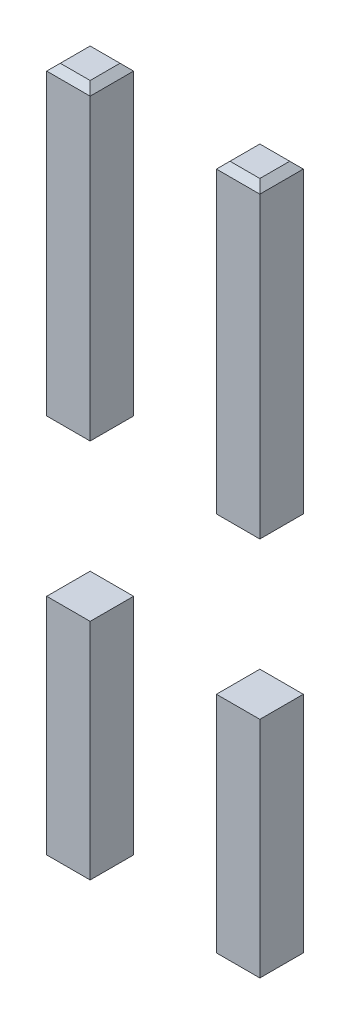
ISO-10303-21;
HEADER;
FILE_DESCRIPTION(('STEP AP214'),'2;1');
FILE_NAME('part.step','',(''),(''),'','','');
FILE_SCHEMA(('AUTOMOTIVE_DESIGN { 1 0 10303 214 1 1 1 1 }'));
ENDSEC;
DATA;
#1=APPLICATION_CONTEXT('core data for automotive mechanical design processes');
#2=APPLICATION_PROTOCOL_DEFINITION('international standard','automotive_design',2000,#1);
#3=PRODUCT_CONTEXT('',#1,'mechanical');
#4=PRODUCT('Part','Part','',(#3));
#5=PRODUCT_RELATED_PRODUCT_CATEGORY('part','',(#4));
#6=PRODUCT_DEFINITION_FORMATION('','',#4);
#7=PRODUCT_DEFINITION_CONTEXT('part definition',#1,'design');
#8=PRODUCT_DEFINITION('design','',#6,#7);
#9=PRODUCT_DEFINITION_SHAPE('','',#8);
#10=(LENGTH_UNIT() NAMED_UNIT(*) SI_UNIT(.MILLI.,.METRE.));
#11=(NAMED_UNIT(*) PLANE_ANGLE_UNIT() SI_UNIT($,.RADIAN.));
#12=(NAMED_UNIT(*) SI_UNIT($,.STERADIAN.) SOLID_ANGLE_UNIT());
#13=UNCERTAINTY_MEASURE_WITH_UNIT(LENGTH_MEASURE(1.E-05),#10,'distance_accuracy_value','');
#14=(GEOMETRIC_REPRESENTATION_CONTEXT(3) GLOBAL_UNCERTAINTY_ASSIGNED_CONTEXT((#13)) GLOBAL_UNIT_ASSIGNED_CONTEXT((#10,
#11,#12)) REPRESENTATION_CONTEXT('',''));
#15=CARTESIAN_POINT('',(0.,0.,0.));
#16=DIRECTION('',(0.,0.,1.));
#17=DIRECTION('',(1.,0.,0.));
#18=AXIS2_PLACEMENT_3D('',#15,#16,#17);
#19=CARTESIAN_POINT('',(-1.57,7.705096679919,0.82));
#20=DIRECTION('',(0.,0.,-1.));
#21=DIRECTION('',(-1.,0.,0.));
#22=AXIS2_PLACEMENT_3D('',#19,#20,#21);
#23=PLANE('',#22);
#24=DIRECTION('',(-1.,0.,0.));
#25=VECTOR('',#24,1.);
#26=CARTESIAN_POINT('',(-1.57,-3.3,0.82));
#27=LINE('',#26,#25);
#28=CARTESIAN_POINT('',(-0.93,-3.3,0.82));
#29=VERTEX_POINT('',#28);
#30=CARTESIAN_POINT('',(-1.57,-3.3,0.82));
#31=VERTEX_POINT('',#30);
#32=EDGE_CURVE('P0_E82',#29,#31,#27,.T.);
#33=ORIENTED_EDGE('',*,*,#32,.F.);
#34=DIRECTION('',(0.,-1.,0.));
#35=VECTOR('',#34,1.);
#36=CARTESIAN_POINT('',(-0.93,7.705096679919,0.82));
#37=LINE('',#36,#35);
#38=CARTESIAN_POINT('',(-0.93,0.,0.82));
#39=VERTEX_POINT('',#38);
#40=EDGE_CURVE('P0_E78',#39,#29,#37,.T.);
#41=ORIENTED_EDGE('',*,*,#40,.F.);
#42=DIRECTION('',(-1.,0.,0.));
#43=VECTOR('',#42,1.);
#44=CARTESIAN_POINT('',(3.7,0.,0.82));
#45=LINE('',#44,#43);
#46=CARTESIAN_POINT('',(-1.57,0.,0.82));
#47=VERTEX_POINT('',#46);
#48=EDGE_CURVE('P0_E80',#39,#47,#45,.T.);
#49=ORIENTED_EDGE('',*,*,#48,.T.);
#50=DIRECTION('',(0.,-1.,0.));
#51=VECTOR('',#50,1.);
#52=CARTESIAN_POINT('',(-1.57,7.705096679919,0.82));
#53=LINE('',#52,#51);
#54=EDGE_CURVE('P0_E11',#47,#31,#53,.T.);
#55=ORIENTED_EDGE('',*,*,#54,.T.);
#56=EDGE_LOOP('',(#33,#41,#49,#55));
#57=FACE_BOUND('',#56,.T.);
#58=ADVANCED_FACE('P0_F17',(#57),#23,.F.);
#59=CARTESIAN_POINT('',(-1.57,7.705096679919,0.82));
#60=DIRECTION('',(1.,0.,0.));
#61=DIRECTION('',(0.,1.,0.));
#62=AXIS2_PLACEMENT_3D('',#59,#60,#61);
#63=PLANE('',#62);
#64=DIRECTION('',(0.,0.,-1.));
#65=VECTOR('',#64,1.);
#66=CARTESIAN_POINT('',(-1.57,-3.3,0.5));
#67=LINE('',#66,#65);
#68=CARTESIAN_POINT('',(-1.57,-3.3,0.18));
#69=VERTEX_POINT('',#68);
#70=EDGE_CURVE('P0_E21',#31,#69,#67,.T.);
#71=ORIENTED_EDGE('',*,*,#70,.F.);
#72=ORIENTED_EDGE('',*,*,#54,.F.);
#73=DIRECTION('',(0.,0.,-1.));
#74=VECTOR('',#73,1.);
#75=CARTESIAN_POINT('',(-1.57,0.,2.875));
#76=LINE('',#75,#74);
#77=CARTESIAN_POINT('',(-1.57,0.,0.18));
#78=VERTEX_POINT('',#77);
#79=EDGE_CURVE('P0_E96',#47,#78,#76,.T.);
#80=ORIENTED_EDGE('',*,*,#79,.T.);
#81=DIRECTION('',(0.,-1.,0.));
#82=VECTOR('',#81,1.);
#83=CARTESIAN_POINT('',(-1.57,7.705096679919,0.18));
#84=LINE('',#83,#82);
#85=EDGE_CURVE('P0_E28',#78,#69,#84,.T.);
#86=ORIENTED_EDGE('',*,*,#85,.T.);
#87=EDGE_LOOP('',(#71,#72,#80,#86));
#88=FACE_BOUND('',#87,.T.);
#89=ADVANCED_FACE('P0_F226',(#88),#63,.F.);
#90=CARTESIAN_POINT('',(-1.57,-3.4,0.18));
#91=DIRECTION('',(0.,-1.,0.));
#92=DIRECTION('',(0.,0.,-1.));
#93=AXIS2_PLACEMENT_3D('',#90,#91,#92);
#94=PLANE('',#93);
#95=DIRECTION('',(-1.,0.,0.));
#96=VECTOR('',#95,1.);
#97=CARTESIAN_POINT('',(-1.57,-3.4,0.28));
#98=LINE('',#97,#96);
#99=CARTESIAN_POINT('',(-1.03,-3.4,0.28));
#100=VERTEX_POINT('',#99);
#101=CARTESIAN_POINT('',(-1.47,-3.4,0.28));
#102=VERTEX_POINT('',#101);
#103=EDGE_CURVE('P0_E113',#100,#102,#98,.T.);
#104=ORIENTED_EDGE('',*,*,#103,.F.);
#105=DIRECTION('',(0.,0.,-1.));
#106=VECTOR('',#105,1.);
#107=CARTESIAN_POINT('',(-1.03,-3.4,0.5));
#108=LINE('',#107,#106);
#109=CARTESIAN_POINT('',(-1.03,-3.4,0.72));
#110=VERTEX_POINT('',#109);
#111=EDGE_CURVE('P0_E123',#110,#100,#108,.T.);
#112=ORIENTED_EDGE('',*,*,#111,.F.);
#113=DIRECTION('',(1.,0.,0.));
#114=VECTOR('',#113,1.);
#115=CARTESIAN_POINT('',(-1.57,-3.4,0.72));
#116=LINE('',#115,#114);
#117=CARTESIAN_POINT('',(-1.47,-3.4,0.72));
#118=VERTEX_POINT('',#117);
#119=EDGE_CURVE('P0_E147',#118,#110,#116,.T.);
#120=ORIENTED_EDGE('',*,*,#119,.F.);
#121=DIRECTION('',(0.,0.,1.));
#122=VECTOR('',#121,1.);
#123=CARTESIAN_POINT('',(-1.47,-3.4,0.5));
#124=LINE('',#123,#122);
#125=EDGE_CURVE('P0_E128',#102,#118,#124,.T.);
#126=ORIENTED_EDGE('',*,*,#125,.F.);
#127=EDGE_LOOP('',(#104,#112,#120,#126));
#128=FACE_BOUND('',#127,.T.);
#129=ADVANCED_FACE('P0_F176',(#128),#94,.T.);
#130=CARTESIAN_POINT('',(-1.57,7.705096679919,0.18));
#131=DIRECTION('',(0.,0.,1.));
#132=DIRECTION('',(1.,0.,0.));
#133=AXIS2_PLACEMENT_3D('',#130,#131,#132);
#134=PLANE('',#133);
#135=DIRECTION('',(1.,0.,0.));
#136=VECTOR('',#135,1.);
#137=CARTESIAN_POINT('',(-1.57,-3.3,0.18));
#138=LINE('',#137,#136);
#139=CARTESIAN_POINT('',(-0.93,-3.3,0.18));
#140=VERTEX_POINT('',#139);
#141=EDGE_CURVE('P0_E98',#69,#140,#138,.T.);
#142=ORIENTED_EDGE('',*,*,#141,.F.);
#143=ORIENTED_EDGE('',*,*,#85,.F.);
#144=DIRECTION('',(1.,0.,0.));
#145=VECTOR('',#144,1.);
#146=CARTESIAN_POINT('',(3.7,0.,0.18));
#147=LINE('',#146,#145);
#148=CARTESIAN_POINT('',(-0.93,0.,0.18));
#149=VERTEX_POINT('',#148);
#150=EDGE_CURVE('P0_E103',#78,#149,#147,.T.);
#151=ORIENTED_EDGE('',*,*,#150,.T.);
#152=DIRECTION('',(0.,-1.,0.));
#153=VECTOR('',#152,1.);
#154=CARTESIAN_POINT('',(-0.93,7.705096679919,0.18));
#155=LINE('',#154,#153);
#156=EDGE_CURVE('P0_E88',#149,#140,#155,.T.);
#157=ORIENTED_EDGE('',*,*,#156,.T.);
#158=EDGE_LOOP('',(#142,#143,#151,#157));
#159=FACE_BOUND('',#158,.T.);
#160=ADVANCED_FACE('P0_F170',(#159),#134,.F.);
#161=CARTESIAN_POINT('',(-0.93,7.705096679919,0.82));
#162=DIRECTION('',(-1.,0.,0.));
#163=DIRECTION('',(0.,1.,0.));
#164=AXIS2_PLACEMENT_3D('',#161,#162,#163);
#165=PLANE('',#164);
#166=DIRECTION('',(0.,0.,1.));
#167=VECTOR('',#166,1.);
#168=CARTESIAN_POINT('',(-0.93,-3.3,0.5));
#169=LINE('',#168,#167);
#170=EDGE_CURVE('P0_E124',#140,#29,#169,.T.);
#171=ORIENTED_EDGE('',*,*,#170,.F.);
#172=ORIENTED_EDGE('',*,*,#156,.F.);
#173=DIRECTION('',(0.,0.,1.));
#174=VECTOR('',#173,1.);
#175=CARTESIAN_POINT('',(-0.93,0.,2.875));
#176=LINE('',#175,#174);
#177=EDGE_CURVE('P0_E94',#149,#39,#176,.T.);
#178=ORIENTED_EDGE('',*,*,#177,.T.);
#179=ORIENTED_EDGE('',*,*,#40,.T.);
#180=EDGE_LOOP('',(#171,#172,#178,#179));
#181=FACE_BOUND('',#180,.T.);
#182=ADVANCED_FACE('P0_F100',(#181),#165,.F.);
#183=CARTESIAN_POINT('',(-1.57,-3.35,0.77));
#184=DIRECTION('',(0.,-0.707106781186548,0.707106781186548));
#185=DIRECTION('',(-1.,0.,0.));
#186=AXIS2_PLACEMENT_3D('',#183,#184,#185);
#187=PLANE('',#186);
#188=ORIENTED_EDGE('',*,*,#32,.T.);
#189=DIRECTION('',(-0.577350269189626,0.577350269189626,0.577350269189626));
#190=VECTOR('',#189,1.);
#191=CARTESIAN_POINT('',(-1.47,-3.4,0.72));
#192=LINE('',#191,#190);
#193=EDGE_CURVE('P0_E125',#118,#31,#192,.T.);
#194=ORIENTED_EDGE('',*,*,#193,.F.);
#195=ORIENTED_EDGE('',*,*,#119,.T.);
#196=DIRECTION('',(-0.577350269189626,-0.577350269189626,-0.577350269189626));
#197=VECTOR('',#196,1.);
#198=CARTESIAN_POINT('',(-0.93,-3.3,0.82));
#199=LINE('',#198,#197);
#200=EDGE_CURVE('P0_E119',#29,#110,#199,.T.);
#201=ORIENTED_EDGE('',*,*,#200,.F.);
#202=EDGE_LOOP('',(#188,#194,#195,#201));
#203=FACE_BOUND('',#202,.T.);
#204=ADVANCED_FACE('P0_F194',(#203),#187,.T.);
#205=CARTESIAN_POINT('',(-1.52,-3.35,0.5));
#206=DIRECTION('',(-0.707106781186548,-0.707106781186548,0.));
#207=DIRECTION('',(-0.707106781186548,0.707106781186548,0.));
#208=AXIS2_PLACEMENT_3D('',#205,#206,#207);
#209=PLANE('',#208);
#210=ORIENTED_EDGE('',*,*,#125,.T.);
#211=ORIENTED_EDGE('',*,*,#193,.T.);
#212=ORIENTED_EDGE('',*,*,#70,.T.);
#213=DIRECTION('',(-0.577350269189626,0.577350269189626,-0.577350269189626));
#214=VECTOR('',#213,1.);
#215=CARTESIAN_POINT('',(-1.47,-3.4,0.28));
#216=LINE('',#215,#214);
#217=EDGE_CURVE('P0_E117',#102,#69,#216,.T.);
#218=ORIENTED_EDGE('',*,*,#217,.F.);
#219=EDGE_LOOP('',(#210,#211,#212,#218));
#220=FACE_BOUND('',#219,.T.);
#221=ADVANCED_FACE('P0_F189',(#220),#209,.T.);
#222=CARTESIAN_POINT('',(-0.98,-3.35,0.5));
#223=DIRECTION('',(0.707106781186548,-0.707106781186548,0.));
#224=DIRECTION('',(0.,0.,-1.));
#225=AXIS2_PLACEMENT_3D('',#222,#223,#224);
#226=PLANE('',#225);
#227=ORIENTED_EDGE('',*,*,#170,.T.);
#228=ORIENTED_EDGE('',*,*,#200,.T.);
#229=ORIENTED_EDGE('',*,*,#111,.T.);
#230=DIRECTION('',(-0.577350269189626,-0.577350269189626,0.577350269189626));
#231=VECTOR('',#230,1.);
#232=CARTESIAN_POINT('',(-0.93,-3.3,0.18));
#233=LINE('',#232,#231);
#234=EDGE_CURVE('P0_E118',#140,#100,#233,.T.);
#235=ORIENTED_EDGE('',*,*,#234,.F.);
#236=EDGE_LOOP('',(#227,#228,#229,#235));
#237=FACE_BOUND('',#236,.T.);
#238=ADVANCED_FACE('P0_F173',(#237),#226,.T.);
#239=CARTESIAN_POINT('',(-1.57,-3.35,0.23));
#240=DIRECTION('',(0.,-0.707106781186548,-0.707106781186548));
#241=DIRECTION('',(0.,-0.707106781186548,0.707106781186548));
#242=AXIS2_PLACEMENT_3D('',#239,#240,#241);
#243=PLANE('',#242);
#244=ORIENTED_EDGE('',*,*,#141,.T.);
#245=ORIENTED_EDGE('',*,*,#234,.T.);
#246=ORIENTED_EDGE('',*,*,#103,.T.);
#247=ORIENTED_EDGE('',*,*,#217,.T.);
#248=EDGE_LOOP('',(#244,#245,#246,#247));
#249=FACE_BOUND('',#248,.T.);
#250=ADVANCED_FACE('P0_F19',(#249),#243,.T.);
#251=CARTESIAN_POINT('',(-0.93,0.,0.));
#252=DIRECTION('',(0.,1.,0.));
#253=DIRECTION('',(1.,0.,0.));
#254=AXIS2_PLACEMENT_3D('',#251,#252,#253);
#255=PLANE('',#254);
#256=ORIENTED_EDGE('',*,*,#177,.F.);
#257=ORIENTED_EDGE('',*,*,#150,.F.);
#258=ORIENTED_EDGE('',*,*,#79,.F.);
#259=ORIENTED_EDGE('',*,*,#48,.F.);
#260=EDGE_LOOP('',(#256,#257,#258,#259));
#261=FACE_BOUND('',#260,.T.);
#262=ADVANCED_FACE('P0_F92',(#261),#255,.T.);
#263=CLOSED_SHELL('',(#58,#89,#129,#160,#182,#204,#221,#238,#250,#262));
#264=MANIFOLD_SOLID_BREP('P0_B1',#263);
#265=CARTESIAN_POINT('',(-0.93,2.3,0.82));
#266=DIRECTION('',(0.,-1.,0.));
#267=DIRECTION('',(0.,0.,-1.));
#268=AXIS2_PLACEMENT_3D('',#265,#266,#267);
#269=PLANE('',#268);
#270=DIRECTION('',(0.,0.,-1.));
#271=VECTOR('',#270,1.);
#272=CARTESIAN_POINT('',(1.57,2.3,-2.05));
#273=LINE('',#272,#271);
#274=CARTESIAN_POINT('',(1.57,2.3,0.82));
#275=VERTEX_POINT('',#274);
#276=CARTESIAN_POINT('',(1.57,2.3,0.18));
#277=VERTEX_POINT('',#276);
#278=EDGE_CURVE('P1_E90',#275,#277,#273,.T.);
#279=ORIENTED_EDGE('',*,*,#278,.F.);
#280=DIRECTION('',(1.,0.,0.));
#281=VECTOR('',#280,1.);
#282=CARTESIAN_POINT('',(-2.85,2.3,0.82));
#283=LINE('',#282,#281);
#284=CARTESIAN_POINT('',(0.93,2.3,0.82));
#285=VERTEX_POINT('',#284);
#286=EDGE_CURVE('P1_E21',#285,#275,#283,.T.);
#287=ORIENTED_EDGE('',*,*,#286,.F.);
#288=DIRECTION('',(0.,0.,1.));
#289=VECTOR('',#288,1.);
#290=CARTESIAN_POINT('',(0.93,2.3,-2.05));
#291=LINE('',#290,#289);
#292=CARTESIAN_POINT('',(0.93,2.3,0.18));
#293=VERTEX_POINT('',#292);
#294=EDGE_CURVE('P1_E100',#293,#285,#291,.T.);
#295=ORIENTED_EDGE('',*,*,#294,.F.);
#296=DIRECTION('',(-1.,0.,0.));
#297=VECTOR('',#296,1.);
#298=CARTESIAN_POINT('',(-2.85,2.3,0.18));
#299=LINE('',#298,#297);
#300=EDGE_CURVE('P1_E40',#277,#293,#299,.T.);
#301=ORIENTED_EDGE('',*,*,#300,.F.);
#302=EDGE_LOOP('',(#279,#287,#295,#301));
#303=FACE_BOUND('',#302,.T.);
#304=ADVANCED_FACE('P1_F17',(#303),#269,.T.);
#305=CARTESIAN_POINT('',(1.52,6.75,0.66));
#306=DIRECTION('',(0.707106781186548,0.707106781186548,0.));
#307=DIRECTION('',(0.,0.,-1.));
#308=AXIS2_PLACEMENT_3D('',#305,#306,#307);
#309=PLANE('',#308);
#310=DIRECTION('',(0.,0.,1.));
#311=VECTOR('',#310,1.);
#312=CARTESIAN_POINT('',(1.47,6.8,0.66));
#313=LINE('',#312,#311);
#314=CARTESIAN_POINT('',(1.47,6.8,0.28));
#315=VERTEX_POINT('',#314);
#316=CARTESIAN_POINT('',(1.47,6.8,0.72));
#317=VERTEX_POINT('',#316);
#318=EDGE_CURVE('P1_E120',#315,#317,#313,.T.);
#319=ORIENTED_EDGE('',*,*,#318,.T.);
#320=DIRECTION('',(0.577350269189626,-0.577350269189626,0.577350269189626));
#321=VECTOR('',#320,1.);
#322=CARTESIAN_POINT('',(1.47,6.8,0.72));
#323=LINE('',#322,#321);
#324=CARTESIAN_POINT('',(1.57,6.7,0.82));
#325=VERTEX_POINT('',#324);
#326=EDGE_CURVE('P1_E11',#317,#325,#323,.T.);
#327=ORIENTED_EDGE('',*,*,#326,.T.);
#328=DIRECTION('',(0.,0.,-1.));
#329=VECTOR('',#328,1.);
#330=CARTESIAN_POINT('',(1.57,6.7,0.66));
#331=LINE('',#330,#329);
#332=CARTESIAN_POINT('',(1.57,6.7,0.18));
#333=VERTEX_POINT('',#332);
#334=EDGE_CURVE('P1_E123',#325,#333,#331,.T.);
#335=ORIENTED_EDGE('',*,*,#334,.T.);
#336=DIRECTION('',(0.577350269189626,-0.577350269189626,-0.577350269189626));
#337=VECTOR('',#336,1.);
#338=CARTESIAN_POINT('',(1.47,6.8,0.28));
#339=LINE('',#338,#337);
#340=EDGE_CURVE('P1_E53',#315,#333,#339,.T.);
#341=ORIENTED_EDGE('',*,*,#340,.F.);
#342=EDGE_LOOP('',(#319,#327,#335,#341));
#343=FACE_BOUND('',#342,.T.);
#344=ADVANCED_FACE('P1_F19',(#343),#309,.T.);
#345=CARTESIAN_POINT('',(0.465,6.75,0.77));
#346=DIRECTION('',(0.,0.707106781186548,0.707106781186548));
#347=DIRECTION('',(1.,0.,0.));
#348=AXIS2_PLACEMENT_3D('',#345,#346,#347);
#349=PLANE('',#348);
#350=DIRECTION('',(1.,0.,0.));
#351=VECTOR('',#350,1.);
#352=CARTESIAN_POINT('',(0.465,6.7,0.82));
#353=LINE('',#352,#351);
#354=CARTESIAN_POINT('',(0.93,6.7,0.82));
#355=VERTEX_POINT('',#354);
#356=EDGE_CURVE('P1_E111',#355,#325,#353,.T.);
#357=ORIENTED_EDGE('',*,*,#356,.T.);
#358=ORIENTED_EDGE('',*,*,#326,.F.);
#359=DIRECTION('',(-1.,0.,0.));
#360=VECTOR('',#359,1.);
#361=CARTESIAN_POINT('',(0.465,6.8,0.72));
#362=LINE('',#361,#360);
#363=CARTESIAN_POINT('',(1.03,6.8,0.72));
#364=VERTEX_POINT('',#363);
#365=EDGE_CURVE('P1_E108',#317,#364,#362,.T.);
#366=ORIENTED_EDGE('',*,*,#365,.T.);
#367=DIRECTION('',(-0.577350269189626,-0.577350269189626,0.577350269189626));
#368=VECTOR('',#367,1.);
#369=CARTESIAN_POINT('',(1.03,6.8,0.72));
#370=LINE('',#369,#368);
#371=EDGE_CURVE('P1_E27',#364,#355,#370,.T.);
#372=ORIENTED_EDGE('',*,*,#371,.T.);
#373=EDGE_LOOP('',(#357,#358,#366,#372));
#374=FACE_BOUND('',#373,.T.);
#375=ADVANCED_FACE('P1_F107',(#374),#349,.T.);
#376=CARTESIAN_POINT('',(0.98,6.75,0.66));
#377=DIRECTION('',(-0.707106781186548,0.707106781186548,0.));
#378=DIRECTION('',(0.,0.,1.));
#379=AXIS2_PLACEMENT_3D('',#376,#377,#378);
#380=PLANE('',#379);
#381=DIRECTION('',(0.,0.,1.));
#382=VECTOR('',#381,1.);
#383=CARTESIAN_POINT('',(0.93,6.7,0.66));
#384=LINE('',#383,#382);
#385=CARTESIAN_POINT('',(0.93,6.7,0.18));
#386=VERTEX_POINT('',#385);
#387=EDGE_CURVE('P1_E138',#386,#355,#384,.T.);
#388=ORIENTED_EDGE('',*,*,#387,.T.);
#389=ORIENTED_EDGE('',*,*,#371,.F.);
#390=DIRECTION('',(0.,0.,-1.));
#391=VECTOR('',#390,1.);
#392=CARTESIAN_POINT('',(1.03,6.8,0.66));
#393=LINE('',#392,#391);
#394=CARTESIAN_POINT('',(1.03,6.8,0.28));
#395=VERTEX_POINT('',#394);
#396=EDGE_CURVE('P1_E121',#364,#395,#393,.T.);
#397=ORIENTED_EDGE('',*,*,#396,.T.);
#398=DIRECTION('',(-0.577350269189626,-0.577350269189626,-0.577350269189626));
#399=VECTOR('',#398,1.);
#400=CARTESIAN_POINT('',(1.03,6.8,0.28));
#401=LINE('',#400,#399);
#402=EDGE_CURVE('P1_E83',#395,#386,#401,.T.);
#403=ORIENTED_EDGE('',*,*,#402,.T.);
#404=EDGE_LOOP('',(#388,#389,#397,#403));
#405=FACE_BOUND('',#404,.T.);
#406=ADVANCED_FACE('P1_F178',(#405),#380,.T.);
#407=CARTESIAN_POINT('',(0.465,6.75,0.23));
#408=DIRECTION('',(0.,0.707106781186548,-0.707106781186548));
#409=DIRECTION('',(-1.,0.,0.));
#410=AXIS2_PLACEMENT_3D('',#407,#408,#409);
#411=PLANE('',#410);
#412=DIRECTION('',(-1.,0.,0.));
#413=VECTOR('',#412,1.);
#414=CARTESIAN_POINT('',(0.465,6.7,0.18));
#415=LINE('',#414,#413);
#416=EDGE_CURVE('P1_E154',#333,#386,#415,.T.);
#417=ORIENTED_EDGE('',*,*,#416,.T.);
#418=ORIENTED_EDGE('',*,*,#402,.F.);
#419=DIRECTION('',(1.,0.,0.));
#420=VECTOR('',#419,1.);
#421=CARTESIAN_POINT('',(0.465,6.8,0.28));
#422=LINE('',#421,#420);
#423=EDGE_CURVE('P1_E126',#395,#315,#422,.T.);
#424=ORIENTED_EDGE('',*,*,#423,.T.);
#425=ORIENTED_EDGE('',*,*,#340,.T.);
#426=EDGE_LOOP('',(#417,#418,#424,#425));
#427=FACE_BOUND('',#426,.T.);
#428=ADVANCED_FACE('P1_F179',(#427),#411,.T.);
#429=CARTESIAN_POINT('',(0.93,7.705096679919,0.18));
#430=DIRECTION('',(0.,0.,1.));
#431=DIRECTION('',(1.,0.,0.));
#432=AXIS2_PLACEMENT_3D('',#429,#430,#431);
#433=PLANE('',#432);
#434=ORIENTED_EDGE('',*,*,#416,.F.);
#435=DIRECTION('',(0.,-1.,0.));
#436=VECTOR('',#435,1.);
#437=CARTESIAN_POINT('',(1.57,7.705096679919,0.18));
#438=LINE('',#437,#436);
#439=EDGE_CURVE('P1_E148',#333,#277,#438,.T.);
#440=ORIENTED_EDGE('',*,*,#439,.T.);
#441=ORIENTED_EDGE('',*,*,#300,.T.);
#442=DIRECTION('',(0.,-1.,0.));
#443=VECTOR('',#442,1.);
#444=CARTESIAN_POINT('',(0.93,7.705096679919,0.18));
#445=LINE('',#444,#443);
#446=EDGE_CURVE('P1_E134',#386,#293,#445,.T.);
#447=ORIENTED_EDGE('',*,*,#446,.F.);
#448=EDGE_LOOP('',(#434,#440,#441,#447));
#449=FACE_BOUND('',#448,.T.);
#450=ADVANCED_FACE('P1_F172',(#449),#433,.F.);
#451=CARTESIAN_POINT('',(1.57,7.705096679919,0.82));
#452=DIRECTION('',(-1.,0.,0.));
#453=DIRECTION('',(0.,1.,0.));
#454=AXIS2_PLACEMENT_3D('',#451,#452,#453);
#455=PLANE('',#454);
#456=ORIENTED_EDGE('',*,*,#334,.F.);
#457=DIRECTION('',(0.,-1.,0.));
#458=VECTOR('',#457,1.);
#459=CARTESIAN_POINT('',(1.57,7.705096679919,0.82));
#460=LINE('',#459,#458);
#461=EDGE_CURVE('P1_E141',#325,#275,#460,.T.);
#462=ORIENTED_EDGE('',*,*,#461,.T.);
#463=ORIENTED_EDGE('',*,*,#278,.T.);
#464=ORIENTED_EDGE('',*,*,#439,.F.);
#465=EDGE_LOOP('',(#456,#462,#463,#464));
#466=FACE_BOUND('',#465,.T.);
#467=ADVANCED_FACE('P1_F187',(#466),#455,.F.);
#468=CARTESIAN_POINT('',(0.,6.8,0.5));
#469=DIRECTION('',(0.,-1.,0.));
#470=DIRECTION('',(0.,0.,-1.));
#471=AXIS2_PLACEMENT_3D('',#468,#469,#470);
#472=PLANE('',#471);
#473=ORIENTED_EDGE('',*,*,#318,.F.);
#474=ORIENTED_EDGE('',*,*,#423,.F.);
#475=ORIENTED_EDGE('',*,*,#396,.F.);
#476=ORIENTED_EDGE('',*,*,#365,.F.);
#477=EDGE_LOOP('',(#473,#474,#475,#476));
#478=FACE_BOUND('',#477,.T.);
#479=ADVANCED_FACE('P1_F118',(#478),#472,.F.);
#480=CARTESIAN_POINT('',(0.93,7.705096679919,0.82));
#481=DIRECTION('',(1.,0.,0.));
#482=DIRECTION('',(0.,1.,0.));
#483=AXIS2_PLACEMENT_3D('',#480,#481,#482);
#484=PLANE('',#483);
#485=ORIENTED_EDGE('',*,*,#387,.F.);
#486=ORIENTED_EDGE('',*,*,#446,.T.);
#487=ORIENTED_EDGE('',*,*,#294,.T.);
#488=DIRECTION('',(0.,-1.,0.));
#489=VECTOR('',#488,1.);
#490=CARTESIAN_POINT('',(0.93,7.705096679919,0.82));
#491=LINE('',#490,#489);
#492=EDGE_CURVE('P1_E151',#355,#285,#491,.T.);
#493=ORIENTED_EDGE('',*,*,#492,.F.);
#494=EDGE_LOOP('',(#485,#486,#487,#493));
#495=FACE_BOUND('',#494,.T.);
#496=ADVANCED_FACE('P1_F177',(#495),#484,.F.);
#497=CARTESIAN_POINT('',(0.93,7.705096679919,0.82));
#498=DIRECTION('',(0.,0.,-1.));
#499=DIRECTION('',(-1.,0.,0.));
#500=AXIS2_PLACEMENT_3D('',#497,#498,#499);
#501=PLANE('',#500);
#502=ORIENTED_EDGE('',*,*,#356,.F.);
#503=ORIENTED_EDGE('',*,*,#492,.T.);
#504=ORIENTED_EDGE('',*,*,#286,.T.);
#505=ORIENTED_EDGE('',*,*,#461,.F.);
#506=EDGE_LOOP('',(#502,#503,#504,#505));
#507=FACE_BOUND('',#506,.T.);
#508=ADVANCED_FACE('P1_F200',(#507),#501,.F.);
#509=CLOSED_SHELL('',(#304,#344,#375,#406,#428,#450,#467,#479,#496,#508));
#510=MANIFOLD_SOLID_BREP('P1_B1',#509);
#511=CARTESIAN_POINT('',(0.93,7.705096679919,0.82));
#512=DIRECTION('',(1.,0.,0.));
#513=DIRECTION('',(0.,1.,0.));
#514=AXIS2_PLACEMENT_3D('',#511,#512,#513);
#515=PLANE('',#514);
#516=DIRECTION('',(0.,0.,-1.));
#517=VECTOR('',#516,1.);
#518=CARTESIAN_POINT('',(0.93,-3.3,0.5));
#519=LINE('',#518,#517);
#520=CARTESIAN_POINT('',(0.93,-3.3,0.82));
#521=VERTEX_POINT('',#520);
#522=CARTESIAN_POINT('',(0.93,-3.3,0.18));
#523=VERTEX_POINT('',#522);
#524=EDGE_CURVE('P2_E106',#521,#523,#519,.T.);
#525=ORIENTED_EDGE('',*,*,#524,.F.);
#526=DIRECTION('',(0.,-1.,0.));
#527=VECTOR('',#526,1.);
#528=CARTESIAN_POINT('',(0.93,7.705096679919,0.82));
#529=LINE('',#528,#527);
#530=CARTESIAN_POINT('',(0.93,0.,0.82));
#531=VERTEX_POINT('',#530);
#532=EDGE_CURVE('P2_E11',#531,#521,#529,.T.);
#533=ORIENTED_EDGE('',*,*,#532,.F.);
#534=DIRECTION('',(0.,0.,-1.));
#535=VECTOR('',#534,1.);
#536=CARTESIAN_POINT('',(0.93,0.,2.875));
#537=LINE('',#536,#535);
#538=CARTESIAN_POINT('',(0.93,0.,0.18));
#539=VERTEX_POINT('',#538);
#540=EDGE_CURVE('P2_E116',#531,#539,#537,.T.);
#541=ORIENTED_EDGE('',*,*,#540,.T.);
#542=DIRECTION('',(0.,-1.,0.));
#543=VECTOR('',#542,1.);
#544=CARTESIAN_POINT('',(0.93,7.705096679919,0.18));
#545=LINE('',#544,#543);
#546=EDGE_CURVE('P2_E27',#539,#523,#545,.T.);
#547=ORIENTED_EDGE('',*,*,#546,.T.);
#548=EDGE_LOOP('',(#525,#533,#541,#547));
#549=FACE_BOUND('',#548,.T.);
#550=ADVANCED_FACE('P2_F17',(#549),#515,.F.);
#551=CARTESIAN_POINT('',(0.93,7.705096679919,0.82));
#552=DIRECTION('',(0.,0.,-1.));
#553=DIRECTION('',(-1.,0.,0.));
#554=AXIS2_PLACEMENT_3D('',#551,#552,#553);
#555=PLANE('',#554);
#556=DIRECTION('',(-1.,0.,0.));
#557=VECTOR('',#556,1.);
#558=CARTESIAN_POINT('',(0.93,-3.3,0.82));
#559=LINE('',#558,#557);
#560=CARTESIAN_POINT('',(1.57,-3.3,0.82));
#561=VERTEX_POINT('',#560);
#562=EDGE_CURVE('P2_E91',#561,#521,#559,.T.);
#563=ORIENTED_EDGE('',*,*,#562,.F.);
#564=DIRECTION('',(0.,-1.,0.));
#565=VECTOR('',#564,1.);
#566=CARTESIAN_POINT('',(1.57,7.705096679919,0.82));
#567=LINE('',#566,#565);
#568=CARTESIAN_POINT('',(1.57,0.,0.82));
#569=VERTEX_POINT('',#568);
#570=EDGE_CURVE('P2_E146',#569,#561,#567,.T.);
#571=ORIENTED_EDGE('',*,*,#570,.F.);
#572=DIRECTION('',(-1.,0.,0.));
#573=VECTOR('',#572,1.);
#574=CARTESIAN_POINT('',(3.7,0.,0.82));
#575=LINE('',#574,#573);
#576=EDGE_CURVE('P2_E135',#569,#531,#575,.T.);
#577=ORIENTED_EDGE('',*,*,#576,.T.);
#578=ORIENTED_EDGE('',*,*,#532,.T.);
#579=EDGE_LOOP('',(#563,#571,#577,#578));
#580=FACE_BOUND('',#579,.T.);
#581=ADVANCED_FACE('P2_F187',(#580),#555,.F.);
#582=CARTESIAN_POINT('',(0.93,-3.4,0.18));
#583=DIRECTION('',(0.,-1.,0.));
#584=DIRECTION('',(0.,0.,-1.));
#585=AXIS2_PLACEMENT_3D('',#582,#583,#584);
#586=PLANE('',#585);
#587=DIRECTION('',(-1.,0.,0.));
#588=VECTOR('',#587,1.);
#589=CARTESIAN_POINT('',(0.93,-3.4,0.28));
#590=LINE('',#589,#588);
#591=CARTESIAN_POINT('',(1.47,-3.4,0.28));
#592=VERTEX_POINT('',#591);
#593=CARTESIAN_POINT('',(1.03,-3.4,0.28));
#594=VERTEX_POINT('',#593);
#595=EDGE_CURVE('P2_E132',#592,#594,#590,.T.);
#596=ORIENTED_EDGE('',*,*,#595,.F.);
#597=DIRECTION('',(0.,0.,-1.));
#598=VECTOR('',#597,1.);
#599=CARTESIAN_POINT('',(1.47,-3.4,0.5));
#600=LINE('',#599,#598);
#601=CARTESIAN_POINT('',(1.47,-3.4,0.72));
#602=VERTEX_POINT('',#601);
#603=EDGE_CURVE('P2_E41',#602,#592,#600,.T.);
#604=ORIENTED_EDGE('',*,*,#603,.F.);
#605=DIRECTION('',(1.,0.,0.));
#606=VECTOR('',#605,1.);
#607=CARTESIAN_POINT('',(0.93,-3.4,0.72));
#608=LINE('',#607,#606);
#609=CARTESIAN_POINT('',(1.03,-3.4,0.72));
#610=VERTEX_POINT('',#609);
#611=EDGE_CURVE('P2_E81',#610,#602,#608,.T.);
#612=ORIENTED_EDGE('',*,*,#611,.F.);
#613=DIRECTION('',(0.,0.,1.));
#614=VECTOR('',#613,1.);
#615=CARTESIAN_POINT('',(1.03,-3.4,0.5));
#616=LINE('',#615,#614);
#617=EDGE_CURVE('P2_E85',#594,#610,#616,.T.);
#618=ORIENTED_EDGE('',*,*,#617,.F.);
#619=EDGE_LOOP('',(#596,#604,#612,#618));
#620=FACE_BOUND('',#619,.T.);
#621=ADVANCED_FACE('P2_F83',(#620),#586,.T.);
#622=CARTESIAN_POINT('',(0.93,7.705096679919,0.18));
#623=DIRECTION('',(0.,0.,1.));
#624=DIRECTION('',(1.,0.,0.));
#625=AXIS2_PLACEMENT_3D('',#622,#623,#624);
#626=PLANE('',#625);
#627=DIRECTION('',(1.,0.,0.));
#628=VECTOR('',#627,1.);
#629=CARTESIAN_POINT('',(0.93,-3.3,0.18));
#630=LINE('',#629,#628);
#631=CARTESIAN_POINT('',(1.57,-3.3,0.18));
#632=VERTEX_POINT('',#631);
#633=EDGE_CURVE('P2_E117',#523,#632,#630,.T.);
#634=ORIENTED_EDGE('',*,*,#633,.F.);
#635=ORIENTED_EDGE('',*,*,#546,.F.);
#636=DIRECTION('',(1.,0.,0.));
#637=VECTOR('',#636,1.);
#638=CARTESIAN_POINT('',(3.7,0.,0.18));
#639=LINE('',#638,#637);
#640=CARTESIAN_POINT('',(1.57,0.,0.18));
#641=VERTEX_POINT('',#640);
#642=EDGE_CURVE('P2_E124',#539,#641,#639,.T.);
#643=ORIENTED_EDGE('',*,*,#642,.T.);
#644=DIRECTION('',(0.,-1.,0.));
#645=VECTOR('',#644,1.);
#646=CARTESIAN_POINT('',(1.57,7.705096679919,0.18));
#647=LINE('',#646,#645);
#648=EDGE_CURVE('P2_E20',#641,#632,#647,.T.);
#649=ORIENTED_EDGE('',*,*,#648,.T.);
#650=EDGE_LOOP('',(#634,#635,#643,#649));
#651=FACE_BOUND('',#650,.T.);
#652=ADVANCED_FACE('P2_F163',(#651),#626,.F.);
#653=CARTESIAN_POINT('',(1.57,7.705096679919,0.82));
#654=DIRECTION('',(-1.,0.,0.));
#655=DIRECTION('',(0.,1.,0.));
#656=AXIS2_PLACEMENT_3D('',#653,#654,#655);
#657=PLANE('',#656);
#658=DIRECTION('',(0.,0.,1.));
#659=VECTOR('',#658,1.);
#660=CARTESIAN_POINT('',(1.57,-3.3,0.5));
#661=LINE('',#660,#659);
#662=EDGE_CURVE('P2_E126',#632,#561,#661,.T.);
#663=ORIENTED_EDGE('',*,*,#662,.F.);
#664=ORIENTED_EDGE('',*,*,#648,.F.);
#665=DIRECTION('',(0.,0.,1.));
#666=VECTOR('',#665,1.);
#667=CARTESIAN_POINT('',(1.57,0.,2.875));
#668=LINE('',#667,#666);
#669=EDGE_CURVE('P2_E121',#641,#569,#668,.T.);
#670=ORIENTED_EDGE('',*,*,#669,.T.);
#671=ORIENTED_EDGE('',*,*,#570,.T.);
#672=EDGE_LOOP('',(#663,#664,#670,#671));
#673=FACE_BOUND('',#672,.T.);
#674=ADVANCED_FACE('P2_F168',(#673),#657,.F.);
#675=CARTESIAN_POINT('',(1.52,-3.35,0.5));
#676=DIRECTION('',(0.707106781186548,-0.707106781186548,0.));
#677=DIRECTION('',(0.,0.,-1.));
#678=AXIS2_PLACEMENT_3D('',#675,#676,#677);
#679=PLANE('',#678);
#680=ORIENTED_EDGE('',*,*,#662,.T.);
#681=DIRECTION('',(0.577350269189626,0.577350269189626,0.577350269189626));
#682=VECTOR('',#681,1.);
#683=CARTESIAN_POINT('',(1.47,-3.4,0.72));
#684=LINE('',#683,#682);
#685=EDGE_CURVE('P2_E90',#602,#561,#684,.T.);
#686=ORIENTED_EDGE('',*,*,#685,.F.);
#687=ORIENTED_EDGE('',*,*,#603,.T.);
#688=DIRECTION('',(0.577350269189626,0.577350269189626,-0.577350269189626));
#689=VECTOR('',#688,1.);
#690=CARTESIAN_POINT('',(1.47,-3.4,0.28));
#691=LINE('',#690,#689);
#692=EDGE_CURVE('P2_E112',#592,#632,#691,.T.);
#693=ORIENTED_EDGE('',*,*,#692,.T.);
#694=EDGE_LOOP('',(#680,#686,#687,#693));
#695=FACE_BOUND('',#694,.T.);
#696=ADVANCED_FACE('P2_F169',(#695),#679,.T.);
#697=CARTESIAN_POINT('',(0.93,-3.35,0.77));
#698=DIRECTION('',(0.,-0.707106781186548,0.707106781186548));
#699=DIRECTION('',(-1.,0.,0.));
#700=AXIS2_PLACEMENT_3D('',#697,#698,#699);
#701=PLANE('',#700);
#702=ORIENTED_EDGE('',*,*,#562,.T.);
#703=DIRECTION('',(-0.577350269189626,0.577350269189626,0.577350269189626));
#704=VECTOR('',#703,1.);
#705=CARTESIAN_POINT('',(1.03,-3.4,0.72));
#706=LINE('',#705,#704);
#707=EDGE_CURVE('P2_E94',#610,#521,#706,.T.);
#708=ORIENTED_EDGE('',*,*,#707,.F.);
#709=ORIENTED_EDGE('',*,*,#611,.T.);
#710=ORIENTED_EDGE('',*,*,#685,.T.);
#711=EDGE_LOOP('',(#702,#708,#709,#710));
#712=FACE_BOUND('',#711,.T.);
#713=ADVANCED_FACE('P2_F95',(#712),#701,.T.);
#714=CARTESIAN_POINT('',(0.98,-3.35,0.5));
#715=DIRECTION('',(-0.707106781186548,-0.707106781186548,0.));
#716=DIRECTION('',(-0.707106781186548,0.707106781186548,0.));
#717=AXIS2_PLACEMENT_3D('',#714,#715,#716);
#718=PLANE('',#717);
#719=ORIENTED_EDGE('',*,*,#524,.T.);
#720=DIRECTION('',(-0.577350269189626,0.577350269189626,-0.577350269189626));
#721=VECTOR('',#720,1.);
#722=CARTESIAN_POINT('',(1.03,-3.4,0.28));
#723=LINE('',#722,#721);
#724=EDGE_CURVE('P2_E103',#594,#523,#723,.T.);
#725=ORIENTED_EDGE('',*,*,#724,.F.);
#726=ORIENTED_EDGE('',*,*,#617,.T.);
#727=ORIENTED_EDGE('',*,*,#707,.T.);
#728=EDGE_LOOP('',(#719,#725,#726,#727));
#729=FACE_BOUND('',#728,.T.);
#730=ADVANCED_FACE('P2_F101',(#729),#718,.T.);
#731=CARTESIAN_POINT('',(0.93,-3.35,0.23));
#732=DIRECTION('',(0.,-0.707106781186548,-0.707106781186548));
#733=DIRECTION('',(0.,-0.707106781186548,0.707106781186548));
#734=AXIS2_PLACEMENT_3D('',#731,#732,#733);
#735=PLANE('',#734);
#736=ORIENTED_EDGE('',*,*,#595,.T.);
#737=ORIENTED_EDGE('',*,*,#724,.T.);
#738=ORIENTED_EDGE('',*,*,#633,.T.);
#739=ORIENTED_EDGE('',*,*,#692,.F.);
#740=EDGE_LOOP('',(#736,#737,#738,#739));
#741=FACE_BOUND('',#740,.T.);
#742=ADVANCED_FACE('P2_F171',(#741),#735,.T.);
#743=CARTESIAN_POINT('',(-0.93,0.,0.));
#744=DIRECTION('',(0.,1.,0.));
#745=DIRECTION('',(1.,0.,0.));
#746=AXIS2_PLACEMENT_3D('',#743,#744,#745);
#747=PLANE('',#746);
#748=ORIENTED_EDGE('',*,*,#669,.F.);
#749=ORIENTED_EDGE('',*,*,#642,.F.);
#750=ORIENTED_EDGE('',*,*,#540,.F.);
#751=ORIENTED_EDGE('',*,*,#576,.F.);
#752=EDGE_LOOP('',(#748,#749,#750,#751));
#753=FACE_BOUND('',#752,.T.);
#754=ADVANCED_FACE('P2_F186',(#753),#747,.T.);
#755=CLOSED_SHELL('',(#550,#581,#621,#652,#674,#696,#713,#730,#742,#754));
#756=MANIFOLD_SOLID_BREP('P2_B1',#755);
#757=CARTESIAN_POINT('',(-0.93,2.3,0.82));
#758=DIRECTION('',(0.,-1.,0.));
#759=DIRECTION('',(0.,0.,-1.));
#760=AXIS2_PLACEMENT_3D('',#757,#758,#759);
#761=PLANE('',#760);
#762=DIRECTION('',(0.,0.,1.));
#763=VECTOR('',#762,1.);
#764=CARTESIAN_POINT('',(-1.57,2.3,-2.05));
#765=LINE('',#764,#763);
#766=CARTESIAN_POINT('',(-1.57,2.3,0.18));
#767=VERTEX_POINT('',#766);
#768=CARTESIAN_POINT('',(-1.57,2.3,0.82));
#769=VERTEX_POINT('',#768);
#770=EDGE_CURVE('P3_E42',#767,#769,#765,.T.);
#771=ORIENTED_EDGE('',*,*,#770,.F.);
#772=DIRECTION('',(-1.,0.,0.));
#773=VECTOR('',#772,1.);
#774=CARTESIAN_POINT('',(-2.85,2.3,0.18));
#775=LINE('',#774,#773);
#776=CARTESIAN_POINT('',(-0.93,2.3,0.18));
#777=VERTEX_POINT('',#776);
#778=EDGE_CURVE('P3_E92',#777,#767,#775,.T.);
#779=ORIENTED_EDGE('',*,*,#778,.F.);
#780=DIRECTION('',(0.,0.,-1.));
#781=VECTOR('',#780,1.);
#782=CARTESIAN_POINT('',(-0.93,2.3,-2.05));
#783=LINE('',#782,#781);
#784=CARTESIAN_POINT('',(-0.93,2.3,0.82));
#785=VERTEX_POINT('',#784);
#786=EDGE_CURVE('P3_E95',#785,#777,#783,.T.);
#787=ORIENTED_EDGE('',*,*,#786,.F.);
#788=DIRECTION('',(1.,0.,0.));
#789=VECTOR('',#788,1.);
#790=CARTESIAN_POINT('',(-2.85,2.3,0.82));
#791=LINE('',#790,#789);
#792=EDGE_CURVE('P3_E132',#769,#785,#791,.T.);
#793=ORIENTED_EDGE('',*,*,#792,.F.);
#794=EDGE_LOOP('',(#771,#779,#787,#793));
#795=FACE_BOUND('',#794,.T.);
#796=ADVANCED_FACE('P3_F17',(#795),#761,.T.);
#797=CARTESIAN_POINT('',(-0.785,6.75,0.23));
#798=DIRECTION('',(0.,0.707106781186548,-0.707106781186548));
#799=DIRECTION('',(-1.,0.,0.));
#800=AXIS2_PLACEMENT_3D('',#797,#798,#799);
#801=PLANE('',#800);
#802=DIRECTION('',(1.,0.,0.));
#803=VECTOR('',#802,1.);
#804=CARTESIAN_POINT('',(-0.785,6.8,0.28));
#805=LINE('',#804,#803);
#806=CARTESIAN_POINT('',(-1.47,6.8,0.28));
#807=VERTEX_POINT('',#806);
#808=CARTESIAN_POINT('',(-1.03,6.8,0.28));
#809=VERTEX_POINT('',#808);
#810=EDGE_CURVE('P3_E109',#807,#809,#805,.T.);
#811=ORIENTED_EDGE('',*,*,#810,.T.);
#812=DIRECTION('',(0.577350269189626,-0.577350269189626,-0.577350269189626));
#813=VECTOR('',#812,1.);
#814=CARTESIAN_POINT('',(-1.03,6.8,0.28));
#815=LINE('',#814,#813);
#816=CARTESIAN_POINT('',(-0.93,6.7,0.18));
#817=VERTEX_POINT('',#816);
#818=EDGE_CURVE('P3_E11',#809,#817,#815,.T.);
#819=ORIENTED_EDGE('',*,*,#818,.T.);
#820=DIRECTION('',(-1.,0.,0.));
#821=VECTOR('',#820,1.);
#822=CARTESIAN_POINT('',(-0.785,6.7,0.18));
#823=LINE('',#822,#821);
#824=CARTESIAN_POINT('',(-1.57,6.7,0.18));
#825=VERTEX_POINT('',#824);
#826=EDGE_CURVE('P3_E21',#817,#825,#823,.T.);
#827=ORIENTED_EDGE('',*,*,#826,.T.);
#828=DIRECTION('',(-0.577350269189626,-0.577350269189626,-0.577350269189626));
#829=VECTOR('',#828,1.);
#830=CARTESIAN_POINT('',(-1.47,6.8,0.28));
#831=LINE('',#830,#829);
#832=EDGE_CURVE('P3_E139',#807,#825,#831,.T.);
#833=ORIENTED_EDGE('',*,*,#832,.F.);
#834=EDGE_LOOP('',(#811,#819,#827,#833));
#835=FACE_BOUND('',#834,.T.);
#836=ADVANCED_FACE('P3_F186',(#835),#801,.T.);
#837=CARTESIAN_POINT('',(-0.98,6.75,0.66));
#838=DIRECTION('',(0.707106781186548,0.707106781186548,0.));
#839=DIRECTION('',(0.,0.,-1.));
#840=AXIS2_PLACEMENT_3D('',#837,#838,#839);
#841=PLANE('',#840);
#842=DIRECTION('',(0.,0.,-1.));
#843=VECTOR('',#842,1.);
#844=CARTESIAN_POINT('',(-0.93,6.7,0.66));
#845=LINE('',#844,#843);
#846=CARTESIAN_POINT('',(-0.93,6.7,0.82));
#847=VERTEX_POINT('',#846);
#848=EDGE_CURVE('P3_E116',#847,#817,#845,.T.);
#849=ORIENTED_EDGE('',*,*,#848,.T.);
#850=ORIENTED_EDGE('',*,*,#818,.F.);
#851=DIRECTION('',(0.,0.,1.));
#852=VECTOR('',#851,1.);
#853=CARTESIAN_POINT('',(-1.03,6.8,0.66));
#854=LINE('',#853,#852);
#855=CARTESIAN_POINT('',(-1.03,6.8,0.72));
#856=VERTEX_POINT('',#855);
#857=EDGE_CURVE('P3_E145',#809,#856,#854,.T.);
#858=ORIENTED_EDGE('',*,*,#857,.T.);
#859=DIRECTION('',(0.577350269189626,-0.577350269189626,0.577350269189626));
#860=VECTOR('',#859,1.);
#861=CARTESIAN_POINT('',(-1.03,6.8,0.72));
#862=LINE('',#861,#860);
#863=EDGE_CURVE('P3_E28',#856,#847,#862,.T.);
#864=ORIENTED_EDGE('',*,*,#863,.T.);
#865=EDGE_LOOP('',(#849,#850,#858,#864));
#866=FACE_BOUND('',#865,.T.);
#867=ADVANCED_FACE('P3_F19',(#866),#841,.T.);
#868=CARTESIAN_POINT('',(-0.785,6.75,0.77));
#869=DIRECTION('',(0.,0.707106781186548,0.707106781186548));
#870=DIRECTION('',(1.,0.,0.));
#871=AXIS2_PLACEMENT_3D('',#868,#869,#870);
#872=PLANE('',#871);
#873=DIRECTION('',(1.,0.,0.));
#874=VECTOR('',#873,1.);
#875=CARTESIAN_POINT('',(-0.785,6.7,0.82));
#876=LINE('',#875,#874);
#877=CARTESIAN_POINT('',(-1.57,6.7,0.82));
#878=VERTEX_POINT('',#877);
#879=EDGE_CURVE('P3_E163',#878,#847,#876,.T.);
#880=ORIENTED_EDGE('',*,*,#879,.T.);
#881=ORIENTED_EDGE('',*,*,#863,.F.);
#882=DIRECTION('',(-1.,0.,0.));
#883=VECTOR('',#882,1.);
#884=CARTESIAN_POINT('',(-0.785,6.8,0.72));
#885=LINE('',#884,#883);
#886=CARTESIAN_POINT('',(-1.47,6.8,0.72));
#887=VERTEX_POINT('',#886);
#888=EDGE_CURVE('P3_E143',#856,#887,#885,.T.);
#889=ORIENTED_EDGE('',*,*,#888,.T.);
#890=DIRECTION('',(-0.577350269189626,-0.577350269189626,0.577350269189626));
#891=VECTOR('',#890,1.);
#892=CARTESIAN_POINT('',(-1.47,6.8,0.72));
#893=LINE('',#892,#891);
#894=EDGE_CURVE('P3_E73',#887,#878,#893,.T.);
#895=ORIENTED_EDGE('',*,*,#894,.T.);
#896=EDGE_LOOP('',(#880,#881,#889,#895));
#897=FACE_BOUND('',#896,.T.);
#898=ADVANCED_FACE('P3_F293',(#897),#872,.T.);
#899=CARTESIAN_POINT('',(-1.52,6.75,0.66));
#900=DIRECTION('',(-0.707106781186548,0.707106781186548,0.));
#901=DIRECTION('',(0.,0.,1.));
#902=AXIS2_PLACEMENT_3D('',#899,#900,#901);
#903=PLANE('',#902);
#904=DIRECTION('',(0.,0.,1.));
#905=VECTOR('',#904,1.);
#906=CARTESIAN_POINT('',(-1.57,6.7,0.66));
#907=LINE('',#906,#905);
#908=EDGE_CURVE('P3_E135',#825,#878,#907,.T.);
#909=ORIENTED_EDGE('',*,*,#908,.T.);
#910=ORIENTED_EDGE('',*,*,#894,.F.);
#911=DIRECTION('',(0.,0.,-1.));
#912=VECTOR('',#911,1.);
#913=CARTESIAN_POINT('',(-1.47,6.8,0.66));
#914=LINE('',#913,#912);
#915=EDGE_CURVE('P3_E129',#887,#807,#914,.T.);
#916=ORIENTED_EDGE('',*,*,#915,.T.);
#917=ORIENTED_EDGE('',*,*,#832,.T.);
#918=EDGE_LOOP('',(#909,#910,#916,#917));
#919=FACE_BOUND('',#918,.T.);
#920=ADVANCED_FACE('P3_F184',(#919),#903,.T.);
#921=CARTESIAN_POINT('',(-1.57,7.705096679919,0.82));
#922=DIRECTION('',(1.,0.,0.));
#923=DIRECTION('',(0.,1.,0.));
#924=AXIS2_PLACEMENT_3D('',#921,#922,#923);
#925=PLANE('',#924);
#926=ORIENTED_EDGE('',*,*,#908,.F.);
#927=DIRECTION('',(0.,-1.,0.));
#928=VECTOR('',#927,1.);
#929=CARTESIAN_POINT('',(-1.57,7.705096679919,0.18));
#930=LINE('',#929,#928);
#931=EDGE_CURVE('P3_E100',#825,#767,#930,.T.);
#932=ORIENTED_EDGE('',*,*,#931,.T.);
#933=ORIENTED_EDGE('',*,*,#770,.T.);
#934=DIRECTION('',(0.,-1.,0.));
#935=VECTOR('',#934,1.);
#936=CARTESIAN_POINT('',(-1.57,7.705096679919,0.82));
#937=LINE('',#936,#935);
#938=EDGE_CURVE('P3_E142',#878,#769,#937,.T.);
#939=ORIENTED_EDGE('',*,*,#938,.F.);
#940=EDGE_LOOP('',(#926,#932,#933,#939));
#941=FACE_BOUND('',#940,.T.);
#942=ADVANCED_FACE('P3_F176',(#941),#925,.F.);
#943=CARTESIAN_POINT('',(-1.57,7.705096679919,0.18));
#944=DIRECTION('',(0.,0.,1.));
#945=DIRECTION('',(1.,0.,0.));
#946=AXIS2_PLACEMENT_3D('',#943,#944,#945);
#947=PLANE('',#946);
#948=ORIENTED_EDGE('',*,*,#826,.F.);
#949=DIRECTION('',(0.,-1.,0.));
#950=VECTOR('',#949,1.);
#951=CARTESIAN_POINT('',(-0.93,7.705096679919,0.18));
#952=LINE('',#951,#950);
#953=EDGE_CURVE('P3_E103',#817,#777,#952,.T.);
#954=ORIENTED_EDGE('',*,*,#953,.T.);
#955=ORIENTED_EDGE('',*,*,#778,.T.);
#956=ORIENTED_EDGE('',*,*,#931,.F.);
#957=EDGE_LOOP('',(#948,#954,#955,#956));
#958=FACE_BOUND('',#957,.T.);
#959=ADVANCED_FACE('P3_F104',(#958),#947,.F.);
#960=CARTESIAN_POINT('',(0.,6.8,0.5));
#961=DIRECTION('',(0.,-1.,0.));
#962=DIRECTION('',(0.,0.,-1.));
#963=AXIS2_PLACEMENT_3D('',#960,#961,#962);
#964=PLANE('',#963);
#965=ORIENTED_EDGE('',*,*,#810,.F.);
#966=ORIENTED_EDGE('',*,*,#915,.F.);
#967=ORIENTED_EDGE('',*,*,#888,.F.);
#968=ORIENTED_EDGE('',*,*,#857,.F.);
#969=EDGE_LOOP('',(#965,#966,#967,#968));
#970=FACE_BOUND('',#969,.T.);
#971=ADVANCED_FACE('P3_F255',(#970),#964,.F.);
#972=CARTESIAN_POINT('',(-0.93,7.705096679919,0.82));
#973=DIRECTION('',(-1.,0.,0.));
#974=DIRECTION('',(0.,1.,0.));
#975=AXIS2_PLACEMENT_3D('',#972,#973,#974);
#976=PLANE('',#975);
#977=ORIENTED_EDGE('',*,*,#848,.F.);
#978=DIRECTION('',(0.,-1.,0.));
#979=VECTOR('',#978,1.);
#980=CARTESIAN_POINT('',(-0.93,7.705096679919,0.82));
#981=LINE('',#980,#979);
#982=EDGE_CURVE('P3_E113',#847,#785,#981,.T.);
#983=ORIENTED_EDGE('',*,*,#982,.T.);
#984=ORIENTED_EDGE('',*,*,#786,.T.);
#985=ORIENTED_EDGE('',*,*,#953,.F.);
#986=EDGE_LOOP('',(#977,#983,#984,#985));
#987=FACE_BOUND('',#986,.T.);
#988=ADVANCED_FACE('P3_F111',(#987),#976,.F.);
#989=CARTESIAN_POINT('',(-1.57,7.705096679919,0.82));
#990=DIRECTION('',(0.,0.,-1.));
#991=DIRECTION('',(-1.,0.,0.));
#992=AXIS2_PLACEMENT_3D('',#989,#990,#991);
#993=PLANE('',#992);
#994=ORIENTED_EDGE('',*,*,#879,.F.);
#995=ORIENTED_EDGE('',*,*,#938,.T.);
#996=ORIENTED_EDGE('',*,*,#792,.T.);
#997=ORIENTED_EDGE('',*,*,#982,.F.);
#998=EDGE_LOOP('',(#994,#995,#996,#997));
#999=FACE_BOUND('',#998,.T.);
#1000=ADVANCED_FACE('P3_F173',(#999),#993,.F.);
#1001=CLOSED_SHELL('',(#796,#836,#867,#898,#920,#942,#959,#971,#988,#1000));
#1002=MANIFOLD_SOLID_BREP('P3_B1',#1001);
#1003=ADVANCED_BREP_SHAPE_REPRESENTATION('',(#18,#264,#510,#756,#1002),#14);
#1004=SHAPE_DEFINITION_REPRESENTATION(#9,#1003);
ENDSEC;
END-ISO-10303-21;
